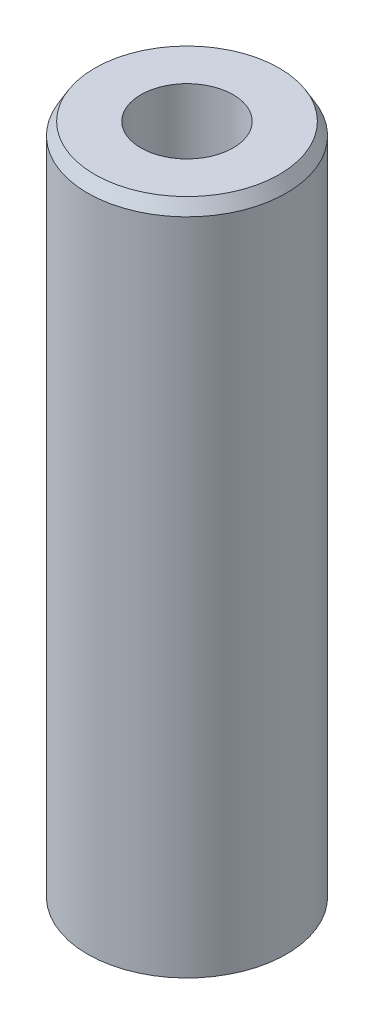
ISO-10303-21;
HEADER;
FILE_DESCRIPTION(('STEP AP214'),'2;1');
FILE_NAME('part.step','',(''),(''),'','','');
FILE_SCHEMA(('AUTOMOTIVE_DESIGN { 1 0 10303 214 1 1 1 1 }'));
ENDSEC;
DATA;
#1=APPLICATION_CONTEXT('core data for automotive mechanical design processes');
#2=APPLICATION_PROTOCOL_DEFINITION('international standard','automotive_design',2000,#1);
#3=PRODUCT_CONTEXT('',#1,'mechanical');
#4=PRODUCT('Part','Part','',(#3));
#5=PRODUCT_RELATED_PRODUCT_CATEGORY('part','',(#4));
#6=PRODUCT_DEFINITION_FORMATION('','',#4);
#7=PRODUCT_DEFINITION_CONTEXT('part definition',#1,'design');
#8=PRODUCT_DEFINITION('design','',#6,#7);
#9=PRODUCT_DEFINITION_SHAPE('','',#8);
#10=(LENGTH_UNIT() NAMED_UNIT(*) SI_UNIT(.MILLI.,.METRE.));
#11=(NAMED_UNIT(*) PLANE_ANGLE_UNIT() SI_UNIT($,.RADIAN.));
#12=(NAMED_UNIT(*) SI_UNIT($,.STERADIAN.) SOLID_ANGLE_UNIT());
#13=UNCERTAINTY_MEASURE_WITH_UNIT(LENGTH_MEASURE(1.E-05),#10,'distance_accuracy_value','');
#14=(GEOMETRIC_REPRESENTATION_CONTEXT(3) GLOBAL_UNCERTAINTY_ASSIGNED_CONTEXT((#13)) GLOBAL_UNIT_ASSIGNED_CONTEXT((#10,
#11,#12)) REPRESENTATION_CONTEXT('',''));
#15=CARTESIAN_POINT('',(0.,0.,0.));
#16=DIRECTION('',(0.,0.,1.));
#17=DIRECTION('',(1.,0.,0.));
#18=AXIS2_PLACEMENT_3D('',#15,#16,#17);
#19=CARTESIAN_POINT('',(0.,238.964466786784,0.));
#20=DIRECTION('',(0.,-1.,0.));
#21=DIRECTION('',(0.,0.,-1.));
#22=AXIS2_PLACEMENT_3D('',#19,#20,#21);
#23=CYLINDRICAL_SURFACE('',#22,35.);
#24=CARTESIAN_POINT('',(0.,234.573774309775,0.));
#25=DIRECTION('',(0.,1.,0.));
#26=DIRECTION('',(0.,0.,1.));
#27=AXIS2_PLACEMENT_3D('',#24,#25,#26);
#28=CIRCLE('',#27,35.);
#29=CARTESIAN_POINT('',(0.,234.573774309775,-35.));
#30=VERTEX_POINT('',#29);
#31=EDGE_CURVE('E50',#30,#30,#28,.F.);
#32=CARTESIAN_POINT('',(0.,2.53496748353016,0.));
#33=DIRECTION('',(0.,1.,0.));
#34=DIRECTION('',(0.,0.,1.));
#35=AXIS2_PLACEMENT_3D('',#32,#33,#34);
#36=CIRCLE('',#35,35.);
#37=CARTESIAN_POINT('',(0.,2.53496748353016,-35.));
#38=VERTEX_POINT('',#37);
#39=EDGE_CURVE('E51',#38,#38,#36,.T.);
#40=CARTESIAN_POINT('',(0.,234.573774309775,-35.));
#41=CARTESIAN_POINT('',(0.,232.156703405335,-35.));
#42=CARTESIAN_POINT('',(0.,229.739632500895,-35.));
#43=CARTESIAN_POINT('',(0.,224.905490692015,-35.));
#44=CARTESIAN_POINT('',(0.,222.488419787575,-35.));
#45=CARTESIAN_POINT('',(0.,217.654277978695,-35.));
#46=CARTESIAN_POINT('',(0.,215.237207074255,-35.));
#47=CARTESIAN_POINT('',(0.,210.403065265375,-35.));
#48=CARTESIAN_POINT('',(0.,207.985994360934,-35.));
#49=CARTESIAN_POINT('',(0.,203.151852552054,-35.));
#50=CARTESIAN_POINT('',(0.,200.734781647614,-35.));
#51=CARTESIAN_POINT('',(0.,195.900639838734,-35.));
#52=CARTESIAN_POINT('',(0.,193.483568934294,-35.));
#53=CARTESIAN_POINT('',(0.,188.649427125414,-35.));
#54=CARTESIAN_POINT('',(0.,186.232356220974,-35.));
#55=CARTESIAN_POINT('',(0.,181.398214412094,-35.));
#56=CARTESIAN_POINT('',(0.,178.981143507654,-35.));
#57=CARTESIAN_POINT('',(0.,174.147001698774,-35.));
#58=CARTESIAN_POINT('',(0.,171.729930794334,-35.));
#59=CARTESIAN_POINT('',(0.,166.895788985454,-35.));
#60=CARTESIAN_POINT('',(0.,164.478718081014,-35.));
#61=CARTESIAN_POINT('',(0.,159.644576272133,-35.));
#62=CARTESIAN_POINT('',(0.,157.227505367693,-35.));
#63=CARTESIAN_POINT('',(0.,152.393363558813,-35.));
#64=CARTESIAN_POINT('',(0.,149.976292654373,-35.));
#65=CARTESIAN_POINT('',(0.,145.142150845493,-35.));
#66=CARTESIAN_POINT('',(0.,142.725079941053,-35.));
#67=CARTESIAN_POINT('',(0.,137.890938132173,-35.));
#68=CARTESIAN_POINT('',(0.,135.473867227733,-35.));
#69=CARTESIAN_POINT('',(0.,130.639725418853,-35.));
#70=CARTESIAN_POINT('',(0.,128.222654514413,-35.));
#71=CARTESIAN_POINT('',(0.,123.388512705533,-35.));
#72=CARTESIAN_POINT('',(0.,120.971441801093,-35.));
#73=CARTESIAN_POINT('',(0.,116.137299992213,-35.));
#74=CARTESIAN_POINT('',(0.,113.720229087773,-35.));
#75=CARTESIAN_POINT('',(0.,108.886087278892,-35.));
#76=CARTESIAN_POINT('',(0.,106.469016374452,-35.));
#77=CARTESIAN_POINT('',(0.,101.634874565572,-35.));
#78=CARTESIAN_POINT('',(0.,99.2178036611322,-35.));
#79=CARTESIAN_POINT('',(0.,94.3836618522521,-35.));
#80=CARTESIAN_POINT('',(0.,91.9665909478121,-35.));
#81=CARTESIAN_POINT('',(0.,87.1324491389319,-35.));
#82=CARTESIAN_POINT('',(0.,84.7153782344919,-35.));
#83=CARTESIAN_POINT('',(0.,79.8812364256118,-35.));
#84=CARTESIAN_POINT('',(0.,77.4641655211718,-35.));
#85=CARTESIAN_POINT('',(0.,72.6300237122916,-35.));
#86=CARTESIAN_POINT('',(0.,70.2129528078516,-35.));
#87=CARTESIAN_POINT('',(0.,65.3788109989715,-35.));
#88=CARTESIAN_POINT('',(0.,62.9617400945314,-35.));
#89=CARTESIAN_POINT('',(0.,58.1275982856513,-35.));
#90=CARTESIAN_POINT('',(0.,55.7105273812113,-35.));
#91=CARTESIAN_POINT('',(0.,50.8763855723312,-35.));
#92=CARTESIAN_POINT('',(0.,48.4593146678911,-35.));
#93=CARTESIAN_POINT('',(0.,43.625172859011,-35.));
#94=CARTESIAN_POINT('',(0.,41.208101954571,-35.));
#95=CARTESIAN_POINT('',(0.,36.3739601456909,-35.));
#96=CARTESIAN_POINT('',(0.,33.9568892412508,-35.));
#97=CARTESIAN_POINT('',(0.,29.1227474323707,-35.));
#98=CARTESIAN_POINT('',(0.,26.7056765279307,-35.));
#99=CARTESIAN_POINT('',(0.,21.8715347190506,-35.));
#100=CARTESIAN_POINT('',(0.,19.4544638146105,-35.));
#101=CARTESIAN_POINT('',(0.,14.6203220057304,-35.));
#102=CARTESIAN_POINT('',(0.,12.2032511012904,-35.));
#103=CARTESIAN_POINT('',(0.,7.36910929241027,-35.));
#104=CARTESIAN_POINT('',(0.,4.95203838797021,-35.));
#105=CARTESIAN_POINT('',(0.,2.53496748353016,-35.));
#106=B_SPLINE_CURVE_WITH_KNOTS('',3,(#40,#41,#42,#43,#44,#45,#46,#47,#48,#49,#50,#51,#52,#53,
#54,#55,#56,#57,#58,#59,#60,#61,#62,#63,#64,#65,#66,#67,#68,#69,#70,#71,#72,#73,#74,#75,#76,#77,
#78,#79,#80,#81,#82,#83,#84,#85,#86,#87,#88,#89,#90,#91,#92,#93,#94,#95,#96,#97,#98,#99,#100,
#101,#102,#103,#104,#105),.UNSPECIFIED.,.F.,.F.,(4,2,2,2,2,2,2,2,2,2,2,2,2,2,2,2,2,2,2,2,2,2,2,
2,2,2,2,2,2,2,2,2,4),(0.,7.25121271332013,14.5024254266403,21.7536381399605,29.0048508532806,
36.2560635666007,43.5072762799209,50.7584889932411,58.0097017065612,65.2609144198814,
72.5121271332015,79.7633398465216,87.0145525598418,94.265765273162,101.516977986482,
108.768190699802,116.019403413122,123.270616126443,130.521828839763,137.773041553083,
145.024254266403,152.275466979723,159.526679693043,166.777892406363,174.029105119684,
181.280317833004,188.531530546324,195.782743259644,203.033955972964,210.285168686284,
217.536381399605,224.787594112925,232.038806826245),.UNSPECIFIED.);
#107=EDGE_CURVE('BSEAM39',#30,#38,#106,.T.);
#108=ORIENTED_EDGE('',*,*,#31,.T.);
#109=ORIENTED_EDGE('',*,*,#39,.T.);
#110=ORIENTED_EDGE('',*,*,#107,.T.);
#111=ORIENTED_EDGE('',*,*,#107,.F.);
#112=EDGE_LOOP('',(#108,#110,#109,#111));
#113=FACE_BOUND('',#112,.T.);
#114=ADVANCED_FACE('F39',(#113),#23,.T.);
#115=CARTESIAN_POINT('',(0.,238.964466786784,0.));
#116=DIRECTION('',(0.,1.,0.));
#117=DIRECTION('',(0.,0.,1.));
#118=AXIS2_PLACEMENT_3D('',#115,#116,#117);
#119=PLANE('',#118);
#120=CARTESIAN_POINT('',(0.,238.964466786784,0.));
#121=DIRECTION('',(0.,1.,0.));
#122=DIRECTION('',(0.,0.,1.));
#123=AXIS2_PLACEMENT_3D('',#120,#121,#122);
#124=CIRCLE('',#123,32.46503251647);
#125=CARTESIAN_POINT('',(0.,238.964466786784,32.46503251647));
#126=VERTEX_POINT('',#125);
#127=EDGE_CURVE('E54',#126,#126,#124,.T.);
#128=ORIENTED_EDGE('',*,*,#127,.T.);
#129=EDGE_LOOP('',(#128));
#130=FACE_BOUND('',#129,.T.);
#131=CARTESIAN_POINT('',(0.,238.964466786784,0.));
#132=DIRECTION('',(0.,1.,0.));
#133=DIRECTION('',(0.,0.,1.));
#134=AXIS2_PLACEMENT_3D('',#131,#132,#133);
#135=CIRCLE('',#134,16.2446501410307);
#136=CARTESIAN_POINT('',(0.,238.964466786784,-16.2446501410307));
#137=VERTEX_POINT('',#136);
#138=EDGE_CURVE('E58',#137,#137,#135,.T.);
#139=ORIENTED_EDGE('',*,*,#138,.F.);
#140=EDGE_LOOP('',(#139));
#141=FACE_BOUND('',#140,.T.);
#142=ADVANCED_FACE('F69',(#130,#141),#119,.T.);
#143=CARTESIAN_POINT('',(0.,0.,0.));
#144=DIRECTION('',(0.,1.,0.));
#145=DIRECTION('',(0.,0.,1.));
#146=AXIS2_PLACEMENT_3D('',#143,#144,#145);
#147=PLANE('',#146);
#148=CARTESIAN_POINT('',(0.,0.,0.));
#149=DIRECTION('',(0.,1.,0.));
#150=DIRECTION('',(0.,0.,1.));
#151=AXIS2_PLACEMENT_3D('',#148,#149,#150);
#152=CIRCLE('',#151,30.6093075229907);
#153=CARTESIAN_POINT('',(0.,0.,30.6093075229907));
#154=VERTEX_POINT('',#153);
#155=EDGE_CURVE('E10',#154,#154,#152,.F.);
#156=ORIENTED_EDGE('',*,*,#155,.T.);
#157=EDGE_LOOP('',(#156));
#158=FACE_BOUND('',#157,.T.);
#159=CARTESIAN_POINT('',(0.,0.,0.));
#160=DIRECTION('',(0.,1.,0.));
#161=DIRECTION('',(0.,0.,1.));
#162=AXIS2_PLACEMENT_3D('',#159,#160,#161);
#163=CIRCLE('',#162,16.2446501410307);
#164=CARTESIAN_POINT('',(0.,0.,-16.2446501410307));
#165=VERTEX_POINT('',#164);
#166=EDGE_CURVE('E63',#165,#165,#163,.T.);
#167=ORIENTED_EDGE('',*,*,#166,.T.);
#168=EDGE_LOOP('',(#167));
#169=FACE_BOUND('',#168,.T.);
#170=ADVANCED_FACE('F75',(#158,#169),#147,.F.);
#171=CARTESIAN_POINT('',(0.,238.964466786784,0.));
#172=DIRECTION('',(0.,-1.,0.));
#173=DIRECTION('',(0.,0.,-1.));
#174=AXIS2_PLACEMENT_3D('',#171,#172,#173);
#175=CYLINDRICAL_SURFACE('',#174,16.2446501410307);
#176=CARTESIAN_POINT('',(0.,238.964466786784,-16.2446501410307));
#177=CARTESIAN_POINT('',(0.,236.475253591088,-16.2446501410307));
#178=CARTESIAN_POINT('',(0.,233.986040395393,-16.2446501410307));
#179=CARTESIAN_POINT('',(0.,229.007614004001,-16.2446501410307));
#180=CARTESIAN_POINT('',(0.,226.518400808306,-16.2446501410307));
#181=CARTESIAN_POINT('',(0.,221.539974416914,-16.2446501410307));
#182=CARTESIAN_POINT('',(0.,219.050761221219,-16.2446501410307));
#183=CARTESIAN_POINT('',(0.,214.072334829827,-16.2446501410307));
#184=CARTESIAN_POINT('',(0.,211.583121634132,-16.2446501410307));
#185=CARTESIAN_POINT('',(0.,206.60469524274,-16.2446501410307));
#186=CARTESIAN_POINT('',(0.,204.115482047045,-16.2446501410307));
#187=CARTESIAN_POINT('',(0.,199.137055655653,-16.2446501410307));
#188=CARTESIAN_POINT('',(0.,196.647842459958,-16.2446501410307));
#189=CARTESIAN_POINT('',(0.,191.669416068566,-16.2446501410307));
#190=CARTESIAN_POINT('',(0.,189.180202872871,-16.2446501410307));
#191=CARTESIAN_POINT('',(0.,184.201776481479,-16.2446501410307));
#192=CARTESIAN_POINT('',(0.,181.712563285784,-16.2446501410307));
#193=CARTESIAN_POINT('',(0.,176.734136894392,-16.2446501410307));
#194=CARTESIAN_POINT('',(0.,174.244923698697,-16.2446501410307));
#195=CARTESIAN_POINT('',(0.,169.266497307305,-16.2446501410307));
#196=CARTESIAN_POINT('',(0.,166.77728411161,-16.2446501410307));
#197=CARTESIAN_POINT('',(0.,161.798857720218,-16.2446501410307));
#198=CARTESIAN_POINT('',(0.,159.309644524523,-16.2446501410307));
#199=CARTESIAN_POINT('',(0.,154.331218133131,-16.2446501410307));
#200=CARTESIAN_POINT('',(0.,151.842004937436,-16.2446501410307));
#201=CARTESIAN_POINT('',(0.,146.863578546044,-16.2446501410307));
#202=CARTESIAN_POINT('',(0.,144.374365350349,-16.2446501410307));
#203=CARTESIAN_POINT('',(0.,139.395938958957,-16.2446501410307));
#204=CARTESIAN_POINT('',(0.,136.906725763262,-16.2446501410307));
#205=CARTESIAN_POINT('',(0.,131.92829937187,-16.2446501410307));
#206=CARTESIAN_POINT('',(0.,129.439086176175,-16.2446501410307));
#207=CARTESIAN_POINT('',(0.,124.460659784783,-16.2446501410307));
#208=CARTESIAN_POINT('',(0.,121.971446589088,-16.2446501410307));
#209=CARTESIAN_POINT('',(0.,116.993020197696,-16.2446501410307));
#210=CARTESIAN_POINT('',(0.,114.503807002001,-16.2446501410307));
#211=CARTESIAN_POINT('',(0.,109.525380610609,-16.2446501410307));
#212=CARTESIAN_POINT('',(0.,107.036167414914,-16.2446501410307));
#213=CARTESIAN_POINT('',(0.,102.057741023522,-16.2446501410307));
#214=CARTESIAN_POINT('',(0.,99.5685278278267,-16.2446501410307));
#215=CARTESIAN_POINT('',(0.,94.5901014364354,-16.2446501410307));
#216=CARTESIAN_POINT('',(0.,92.1008882407397,-16.2446501410307));
#217=CARTESIAN_POINT('',(0.,87.1224618493484,-16.2446501410307));
#218=CARTESIAN_POINT('',(0.,84.6332486536527,-16.2446501410307));
#219=CARTESIAN_POINT('',(0.,79.6548222622614,-16.2446501410307));
#220=CARTESIAN_POINT('',(0.,77.1656090665657,-16.2446501410307));
#221=CARTESIAN_POINT('',(0.,72.1871826751744,-16.2446501410307));
#222=CARTESIAN_POINT('',(0.,69.6979694794787,-16.2446501410307));
#223=CARTESIAN_POINT('',(0.,64.7195430880874,-16.2446501410307));
#224=CARTESIAN_POINT('',(0.,62.2303298923917,-16.2446501410307));
#225=CARTESIAN_POINT('',(0.,57.2519035010003,-16.2446501410307));
#226=CARTESIAN_POINT('',(0.,54.7626903053047,-16.2446501410307));
#227=CARTESIAN_POINT('',(0.,49.7842639139134,-16.2446501410307));
#228=CARTESIAN_POINT('',(0.,47.2950507182177,-16.2446501410307));
#229=CARTESIAN_POINT('',(0.,42.3166243268263,-16.2446501410307));
#230=CARTESIAN_POINT('',(0.,39.8274111311307,-16.2446501410307));
#231=CARTESIAN_POINT('',(0.,34.8489847397394,-16.2446501410307));
#232=CARTESIAN_POINT('',(0.,32.3597715440437,-16.2446501410307));
#233=CARTESIAN_POINT('',(0.,27.3813451526523,-16.2446501410307));
#234=CARTESIAN_POINT('',(0.,24.8921319569567,-16.2446501410307));
#235=CARTESIAN_POINT('',(0.,19.9137055655653,-16.2446501410307));
#236=CARTESIAN_POINT('',(0.,17.4244923698697,-16.2446501410307));
#237=CARTESIAN_POINT('',(0.,12.4460659784783,-16.2446501410307));
#238=CARTESIAN_POINT('',(0.,9.95685278278268,-16.2446501410307));
#239=CARTESIAN_POINT('',(0.,4.97842639139134,-16.2446501410307));
#240=CARTESIAN_POINT('',(0.,2.48921319569567,-16.2446501410307));
#241=CARTESIAN_POINT('',(0.,0.,-16.2446501410307));
#242=B_SPLINE_CURVE_WITH_KNOTS('',3,(#176,#177,#178,#179,#180,#181,#182,#183,#184,#185,#186,
#187,#188,#189,#190,#191,#192,#193,#194,#195,#196,#197,#198,#199,#200,#201,#202,#203,#204,#205,
#206,#207,#208,#209,#210,#211,#212,#213,#214,#215,#216,#217,#218,#219,#220,#221,#222,#223,#224,
#225,#226,#227,#228,#229,#230,#231,#232,#233,#234,#235,#236,#237,#238,#239,#240,#241),
.UNSPECIFIED.,.F.,.F.,(4,2,2,2,2,2,2,2,2,2,2,2,2,2,2,2,2,2,2,2,2,2,2,2,2,2,2,2,2,2,2,2,4),(0.,
7.46763958708699,14.935279174174,22.402918761261,29.870558348348,37.338197935435,
44.805837522522,52.273477109609,59.741116696696,67.208756283783,74.67639587087,82.144035457957,
89.611675045044,97.079314632131,104.546954219218,112.014593806305,119.482233393392,
126.949872980479,134.417512567566,141.885152154653,149.35279174174,156.820431328827,
164.288070915914,171.755710503001,179.223350090088,186.690989677175,194.158629264262,
201.626268851349,209.093908438436,216.561548025523,224.02918761261,231.496827199697,
238.964466786784),.UNSPECIFIED.);
#243=EDGE_CURVE('BSEAM70',#137,#165,#242,.T.);
#244=ORIENTED_EDGE('',*,*,#138,.T.);
#245=ORIENTED_EDGE('',*,*,#166,.F.);
#246=ORIENTED_EDGE('',*,*,#243,.T.);
#247=ORIENTED_EDGE('',*,*,#243,.F.);
#248=EDGE_LOOP('',(#244,#246,#245,#247));
#249=FACE_BOUND('',#248,.T.);
#250=ADVANCED_FACE('F70',(#249),#175,.F.);
#251=CARTESIAN_POINT('',(0.,238.964466786784,0.));
#252=DIRECTION('',(0.,-1.,0.));
#253=DIRECTION('',(0.,0.,-1.));
#254=AXIS2_PLACEMENT_3D('',#251,#252,#253);
#255=CONICAL_SURFACE('',#254,32.46503251647,0.523598775598294);
#256=ORIENTED_EDGE('',*,*,#31,.F.);
#257=EDGE_LOOP('',(#256));
#258=FACE_BOUND('',#257,.T.);
#259=ORIENTED_EDGE('',*,*,#127,.F.);
#260=EDGE_LOOP('',(#259));
#261=FACE_BOUND('',#260,.T.);
#262=ADVANCED_FACE('F81',(#258,#261),#255,.T.);
#263=CARTESIAN_POINT('',(0.,2.53496748353016,0.));
#264=DIRECTION('',(0.,1.,0.));
#265=DIRECTION('',(0.,0.,1.));
#266=AXIS2_PLACEMENT_3D('',#263,#264,#265);
#267=CONICAL_SURFACE('',#266,35.,1.0471975511966);
#268=ORIENTED_EDGE('',*,*,#155,.F.);
#269=EDGE_LOOP('',(#268));
#270=FACE_BOUND('',#269,.T.);
#271=ORIENTED_EDGE('',*,*,#39,.F.);
#272=EDGE_LOOP('',(#271));
#273=FACE_BOUND('',#272,.T.);
#274=ADVANCED_FACE('F45',(#270,#273),#267,.T.);
#275=CLOSED_SHELL('',(#114,#142,#170,#250,#262,#274));
#276=MANIFOLD_SOLID_BREP('B2',#275);
#277=ADVANCED_BREP_SHAPE_REPRESENTATION('',(#18,#276),#14);
#278=SHAPE_DEFINITION_REPRESENTATION(#9,#277);
ENDSEC;
END-ISO-10303-21;
